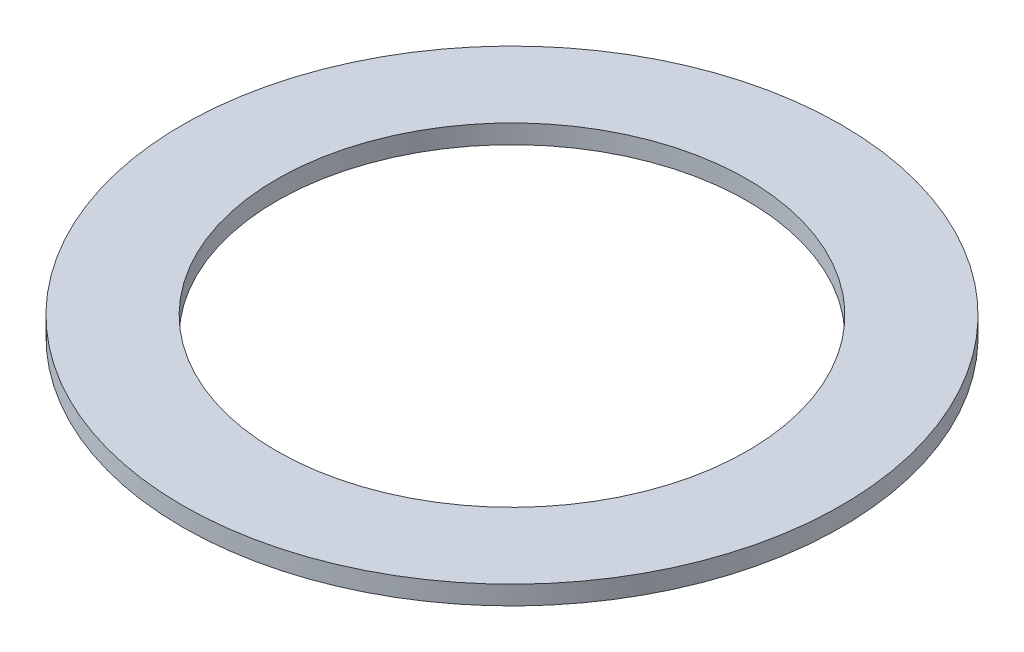
ISO-10303-21;
HEADER;
FILE_DESCRIPTION(('STEP AP214'),'2;1');
FILE_NAME('part.step','',(''),(''),'','','');
FILE_SCHEMA(('AUTOMOTIVE_DESIGN { 1 0 10303 214 1 1 1 1 }'));
ENDSEC;
DATA;
#1=APPLICATION_CONTEXT('core data for automotive mechanical design processes');
#2=APPLICATION_PROTOCOL_DEFINITION('international standard','automotive_design',2000,#1);
#3=PRODUCT_CONTEXT('',#1,'mechanical');
#4=PRODUCT('Part','Part','',(#3));
#5=PRODUCT_RELATED_PRODUCT_CATEGORY('part','',(#4));
#6=PRODUCT_DEFINITION_FORMATION('','',#4);
#7=PRODUCT_DEFINITION_CONTEXT('part definition',#1,'design');
#8=PRODUCT_DEFINITION('design','',#6,#7);
#9=PRODUCT_DEFINITION_SHAPE('','',#8);
#10=(LENGTH_UNIT() NAMED_UNIT(*) SI_UNIT(.MILLI.,.METRE.));
#11=(NAMED_UNIT(*) PLANE_ANGLE_UNIT() SI_UNIT($,.RADIAN.));
#12=(NAMED_UNIT(*) SI_UNIT($,.STERADIAN.) SOLID_ANGLE_UNIT());
#13=UNCERTAINTY_MEASURE_WITH_UNIT(LENGTH_MEASURE(1.E-05),#10,'distance_accuracy_value','');
#14=(GEOMETRIC_REPRESENTATION_CONTEXT(3) GLOBAL_UNCERTAINTY_ASSIGNED_CONTEXT((#13)) GLOBAL_UNIT_ASSIGNED_CONTEXT((#10,
#11,#12)) REPRESENTATION_CONTEXT('',''));
#15=CARTESIAN_POINT('',(0.,0.,0.));
#16=DIRECTION('',(0.,0.,1.));
#17=DIRECTION('',(1.,0.,0.));
#18=AXIS2_PLACEMENT_3D('',#15,#16,#17);
#19=CARTESIAN_POINT('',(0.,0.199999999999978,0.));
#20=DIRECTION('',(0.,-1.,0.));
#21=DIRECTION('',(0.,0.,-1.));
#22=AXIS2_PLACEMENT_3D('',#19,#20,#21);
#23=CYLINDRICAL_SURFACE('',#22,3.5);
#24=CARTESIAN_POINT('',(0.,0.199999999999978,0.));
#25=DIRECTION('',(0.,1.,0.));
#26=DIRECTION('',(0.,0.,1.));
#27=AXIS2_PLACEMENT_3D('',#24,#25,#26);
#28=CIRCLE('',#27,3.5);
#29=CARTESIAN_POINT('',(0.,0.199999999999978,3.50000000000001));
#30=VERTEX_POINT('',#29);
#31=EDGE_CURVE('E10',#30,#30,#28,.T.);
#32=ORIENTED_EDGE('',*,*,#31,.F.);
#33=EDGE_LOOP('',(#32));
#34=FACE_BOUND('',#33,.T.);
#35=CARTESIAN_POINT('',(0.,0.,0.));
#36=DIRECTION('',(0.,1.,0.));
#37=DIRECTION('',(0.,0.,1.));
#38=AXIS2_PLACEMENT_3D('',#35,#36,#37);
#39=CIRCLE('',#38,3.5);
#40=CARTESIAN_POINT('',(0.,0.,3.50000000000001));
#41=VERTEX_POINT('',#40);
#42=EDGE_CURVE('E35',#41,#41,#39,.T.);
#43=ORIENTED_EDGE('',*,*,#42,.T.);
#44=EDGE_LOOP('',(#43));
#45=FACE_BOUND('',#44,.T.);
#46=ADVANCED_FACE('F32',(#34,#45),#23,.T.);
#47=CARTESIAN_POINT('',(0.,0.199999999999978,0.));
#48=DIRECTION('',(0.,1.,0.));
#49=DIRECTION('',(0.,0.,1.));
#50=AXIS2_PLACEMENT_3D('',#47,#48,#49);
#51=PLANE('',#50);
#52=CARTESIAN_POINT('',(0.,0.199999999999978,0.));
#53=DIRECTION('',(0.,1.,0.));
#54=DIRECTION('',(0.,0.,1.));
#55=AXIS2_PLACEMENT_3D('',#52,#53,#54);
#56=CIRCLE('',#55,2.5);
#57=CARTESIAN_POINT('',(0.,0.199999999999978,2.50000000000001));
#58=VERTEX_POINT('',#57);
#59=EDGE_CURVE('E44',#58,#58,#56,.T.);
#60=ORIENTED_EDGE('',*,*,#59,.F.);
#61=EDGE_LOOP('',(#60));
#62=FACE_BOUND('',#61,.T.);
#63=ORIENTED_EDGE('',*,*,#31,.T.);
#64=EDGE_LOOP('',(#63));
#65=FACE_BOUND('',#64,.T.);
#66=ADVANCED_FACE('F59',(#62,#65),#51,.T.);
#67=CARTESIAN_POINT('',(0.,0.,0.));
#68=DIRECTION('',(0.,1.,0.));
#69=DIRECTION('',(0.,0.,1.));
#70=AXIS2_PLACEMENT_3D('',#67,#68,#69);
#71=PLANE('',#70);
#72=CARTESIAN_POINT('',(0.,0.,0.));
#73=DIRECTION('',(0.,1.,0.));
#74=DIRECTION('',(0.,0.,1.));
#75=AXIS2_PLACEMENT_3D('',#72,#73,#74);
#76=CIRCLE('',#75,2.5);
#77=CARTESIAN_POINT('',(0.,0.,2.50000000000001));
#78=VERTEX_POINT('',#77);
#79=EDGE_CURVE('E42',#78,#78,#76,.T.);
#80=ORIENTED_EDGE('',*,*,#79,.T.);
#81=EDGE_LOOP('',(#80));
#82=FACE_BOUND('',#81,.T.);
#83=ORIENTED_EDGE('',*,*,#42,.F.);
#84=EDGE_LOOP('',(#83));
#85=FACE_BOUND('',#84,.T.);
#86=ADVANCED_FACE('F50',(#82,#85),#71,.F.);
#87=CARTESIAN_POINT('',(0.,0.,0.));
#88=DIRECTION('',(0.,1.,0.));
#89=DIRECTION('',(0.,0.,1.));
#90=AXIS2_PLACEMENT_3D('',#87,#88,#89);
#91=CYLINDRICAL_SURFACE('',#90,2.5);
#92=ORIENTED_EDGE('',*,*,#79,.F.);
#93=EDGE_LOOP('',(#92));
#94=FACE_BOUND('',#93,.T.);
#95=ORIENTED_EDGE('',*,*,#59,.T.);
#96=EDGE_LOOP('',(#95));
#97=FACE_BOUND('',#96,.T.);
#98=ADVANCED_FACE('F53',(#94,#97),#91,.F.);
#99=CLOSED_SHELL('',(#46,#66,#86,#98));
#100=MANIFOLD_SOLID_BREP('B2',#99);
#101=ADVANCED_BREP_SHAPE_REPRESENTATION('',(#18,#100),#14);
#102=SHAPE_DEFINITION_REPRESENTATION(#9,#101);
ENDSEC;
END-ISO-10303-21;
